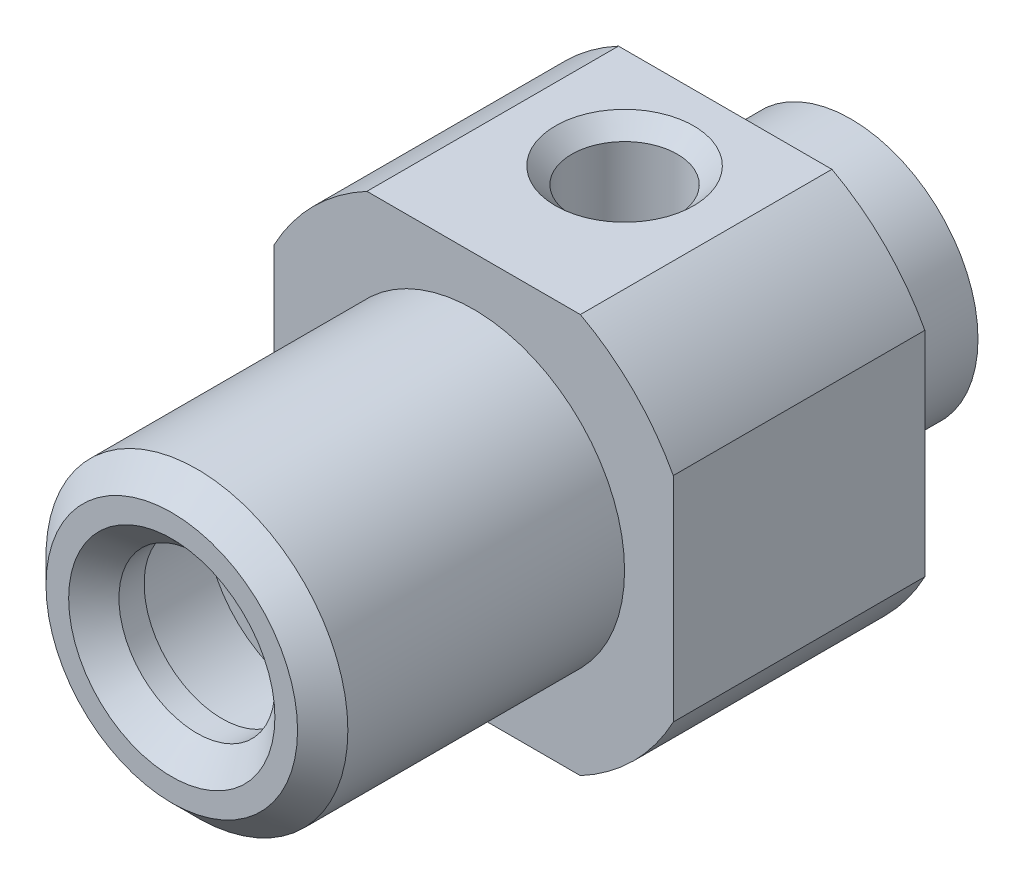
ISO-10303-21;
HEADER;
FILE_DESCRIPTION(('STEP AP214'),'2;1');
FILE_NAME('part.step','',(''),(''),'','','');
FILE_SCHEMA(('AUTOMOTIVE_DESIGN { 1 0 10303 214 1 1 1 1 }'));
ENDSEC;
DATA;
#1=APPLICATION_CONTEXT('core data for automotive mechanical design processes');
#2=APPLICATION_PROTOCOL_DEFINITION('international standard','automotive_design',2000,#1);
#3=PRODUCT_CONTEXT('',#1,'mechanical');
#4=PRODUCT('Part','Part','',(#3));
#5=PRODUCT_RELATED_PRODUCT_CATEGORY('part','',(#4));
#6=PRODUCT_DEFINITION_FORMATION('','',#4);
#7=PRODUCT_DEFINITION_CONTEXT('part definition',#1,'design');
#8=PRODUCT_DEFINITION('design','',#6,#7);
#9=PRODUCT_DEFINITION_SHAPE('','',#8);
#10=(LENGTH_UNIT() NAMED_UNIT(*) SI_UNIT(.MILLI.,.METRE.));
#11=(NAMED_UNIT(*) PLANE_ANGLE_UNIT() SI_UNIT($,.RADIAN.));
#12=(NAMED_UNIT(*) SI_UNIT($,.STERADIAN.) SOLID_ANGLE_UNIT());
#13=UNCERTAINTY_MEASURE_WITH_UNIT(LENGTH_MEASURE(1.E-05),#10,'distance_accuracy_value','');
#14=(GEOMETRIC_REPRESENTATION_CONTEXT(3) GLOBAL_UNCERTAINTY_ASSIGNED_CONTEXT((#13)) GLOBAL_UNIT_ASSIGNED_CONTEXT((#10,
#11,#12)) REPRESENTATION_CONTEXT('',''));
#15=CARTESIAN_POINT('',(0.,0.,0.));
#16=DIRECTION('',(0.,0.,1.));
#17=DIRECTION('',(1.,0.,0.));
#18=AXIS2_PLACEMENT_3D('',#15,#16,#17);
#19=CARTESIAN_POINT('',(0.,6.,1.5));
#20=DIRECTION('',(0.,0.,-1.));
#21=DIRECTION('',(-1.,0.,0.));
#22=AXIS2_PLACEMENT_3D('',#19,#20,#21);
#23=PLANE('',#22);
#24=CARTESIAN_POINT('',(0.,0.,1.5));
#25=DIRECTION('',(0.,0.,1.));
#26=DIRECTION('',(1.,0.,0.));
#27=AXIS2_PLACEMENT_3D('',#24,#25,#26);
#28=CIRCLE('',#27,6.);
#29=CARTESIAN_POINT('',(6.,0.,1.5));
#30=VERTEX_POINT('',#29);
#31=EDGE_CURVE('E237',#30,#30,#28,.T.);
#32=ORIENTED_EDGE('',*,*,#31,.F.);
#33=EDGE_LOOP('',(#32));
#34=FACE_BOUND('',#33,.T.);
#35=CARTESIAN_POINT('',(0.,0.,1.5));
#36=DIRECTION('',(0.,0.,1.));
#37=DIRECTION('',(1.,0.,0.));
#38=AXIS2_PLACEMENT_3D('',#35,#36,#37);
#39=CIRCLE('',#38,9.);
#40=CARTESIAN_POINT('',(7.9375,4.24218030616332,1.5));
#41=VERTEX_POINT('',#40);
#42=CARTESIAN_POINT('',(4.24218030616333,7.9375,1.5));
#43=VERTEX_POINT('',#42);
#44=EDGE_CURVE('E240',#41,#43,#39,.T.);
#45=ORIENTED_EDGE('',*,*,#44,.T.);
#46=DIRECTION('',(1.,0.,0.));
#47=VECTOR('',#46,1.);
#48=CARTESIAN_POINT('',(0.,7.9375,1.5));
#49=LINE('',#48,#47);
#50=CARTESIAN_POINT('',(-4.24218030616333,7.9375,1.5));
#51=VERTEX_POINT('',#50);
#52=EDGE_CURVE('E277',#51,#43,#49,.T.);
#53=ORIENTED_EDGE('',*,*,#52,.F.);
#54=CARTESIAN_POINT('',(-7.9375,4.24218030616333,1.5));
#55=VERTEX_POINT('',#54);
#56=EDGE_CURVE('E243',#51,#55,#39,.T.);
#57=ORIENTED_EDGE('',*,*,#56,.T.);
#58=DIRECTION('',(0.,1.,0.));
#59=VECTOR('',#58,1.);
#60=CARTESIAN_POINT('',(-7.9375,0.,1.5));
#61=LINE('',#60,#59);
#62=CARTESIAN_POINT('',(-7.9375,-4.24218030616333,1.5));
#63=VERTEX_POINT('',#62);
#64=EDGE_CURVE('E278',#63,#55,#61,.T.);
#65=ORIENTED_EDGE('',*,*,#64,.F.);
#66=CARTESIAN_POINT('',(-4.24218030616332,-7.9375,1.5));
#67=VERTEX_POINT('',#66);
#68=EDGE_CURVE('E349',#63,#67,#39,.T.);
#69=ORIENTED_EDGE('',*,*,#68,.T.);
#70=DIRECTION('',(1.,0.,0.));
#71=VECTOR('',#70,1.);
#72=CARTESIAN_POINT('',(0.,-7.9375,1.5));
#73=LINE('',#72,#71);
#74=CARTESIAN_POINT('',(4.24218030616332,-7.9375,1.5));
#75=VERTEX_POINT('',#74);
#76=EDGE_CURVE('E280',#67,#75,#73,.T.);
#77=ORIENTED_EDGE('',*,*,#76,.T.);
#78=CARTESIAN_POINT('',(7.9375,-4.24218030616333,1.5));
#79=VERTEX_POINT('',#78);
#80=EDGE_CURVE('E244',#75,#79,#39,.T.);
#81=ORIENTED_EDGE('',*,*,#80,.T.);
#82=DIRECTION('',(0.,1.,0.));
#83=VECTOR('',#82,1.);
#84=CARTESIAN_POINT('',(7.9375,0.,1.5));
#85=LINE('',#84,#83);
#86=EDGE_CURVE('E293',#79,#41,#85,.T.);
#87=ORIENTED_EDGE('',*,*,#86,.T.);
#88=EDGE_LOOP('',(#45,#53,#57,#65,#69,#77,#81,#87));
#89=FACE_BOUND('',#88,.T.);
#90=ADVANCED_FACE('F40',(#34,#89),#23,.F.);
#91=CARTESIAN_POINT('',(0.,0.,0.));
#92=DIRECTION('',(0.,0.,1.));
#93=DIRECTION('',(1.,0.,0.));
#94=AXIS2_PLACEMENT_3D('',#91,#92,#93);
#95=CYLINDRICAL_SURFACE('',#94,9.);
#96=CARTESIAN_POINT('',(0.,0.,-8.5));
#97=DIRECTION('',(0.,0.,1.));
#98=DIRECTION('',(1.,0.,0.));
#99=AXIS2_PLACEMENT_3D('',#96,#97,#98);
#100=CIRCLE('',#99,9.);
#101=CARTESIAN_POINT('',(7.9375,4.24218030616332,-8.5));
#102=VERTEX_POINT('',#101);
#103=CARTESIAN_POINT('',(4.24218030616333,7.9375,-8.5));
#104=VERTEX_POINT('',#103);
#105=EDGE_CURVE('E245',#102,#104,#100,.T.);
#106=ORIENTED_EDGE('',*,*,#105,.T.);
#107=DIRECTION('',(0.,0.,-1.));
#108=VECTOR('',#107,1.);
#109=CARTESIAN_POINT('',(4.24218030616333,7.9375,13.501));
#110=LINE('',#109,#108);
#111=EDGE_CURVE('E309',#43,#104,#110,.T.);
#112=ORIENTED_EDGE('',*,*,#111,.F.);
#113=ORIENTED_EDGE('',*,*,#44,.F.);
#114=DIRECTION('',(0.,0.,-1.));
#115=VECTOR('',#114,1.);
#116=CARTESIAN_POINT('',(7.9375,4.24218030616332,13.501));
#117=LINE('',#116,#115);
#118=EDGE_CURVE('E298',#41,#102,#117,.T.);
#119=ORIENTED_EDGE('',*,*,#118,.T.);
#120=EDGE_LOOP('',(#106,#112,#113,#119));
#121=FACE_BOUND('',#120,.T.);
#122=ADVANCED_FACE('F190',(#121),#95,.T.);
#123=ORIENTED_EDGE('',*,*,#56,.F.);
#124=DIRECTION('',(0.,0.,-1.));
#125=VECTOR('',#124,1.);
#126=CARTESIAN_POINT('',(-4.24218030616333,7.9375,13.501));
#127=LINE('',#126,#125);
#128=CARTESIAN_POINT('',(-4.24218030616333,7.9375,-8.5));
#129=VERTEX_POINT('',#128);
#130=EDGE_CURVE('E308',#51,#129,#127,.T.);
#131=ORIENTED_EDGE('',*,*,#130,.T.);
#132=CARTESIAN_POINT('',(-7.9375,4.24218030616333,-8.5));
#133=VERTEX_POINT('',#132);
#134=EDGE_CURVE('E248',#129,#133,#100,.T.);
#135=ORIENTED_EDGE('',*,*,#134,.T.);
#136=DIRECTION('',(0.,0.,-1.));
#137=VECTOR('',#136,1.);
#138=CARTESIAN_POINT('',(-7.9375,4.24218030616333,13.501));
#139=LINE('',#138,#137);
#140=EDGE_CURVE('E282',#55,#133,#139,.T.);
#141=ORIENTED_EDGE('',*,*,#140,.F.);
#142=EDGE_LOOP('',(#123,#131,#135,#141));
#143=FACE_BOUND('',#142,.T.);
#144=ADVANCED_FACE('F196',(#143),#95,.T.);
#145=DIRECTION('',(0.,0.,-1.));
#146=VECTOR('',#145,1.);
#147=CARTESIAN_POINT('',(7.9375,-4.24218030616333,13.501));
#148=LINE('',#147,#146);
#149=CARTESIAN_POINT('',(7.9375,-4.24218030616333,-8.5));
#150=VERTEX_POINT('',#149);
#151=EDGE_CURVE('E69',#79,#150,#148,.T.);
#152=ORIENTED_EDGE('',*,*,#151,.F.);
#153=ORIENTED_EDGE('',*,*,#80,.F.);
#154=DIRECTION('',(0.,0.,-1.));
#155=VECTOR('',#154,1.);
#156=CARTESIAN_POINT('',(4.24218030616332,-7.9375,13.501));
#157=LINE('',#156,#155);
#158=CARTESIAN_POINT('',(4.24218030616332,-7.9375,-8.5));
#159=VERTEX_POINT('',#158);
#160=EDGE_CURVE('E287',#75,#159,#157,.T.);
#161=ORIENTED_EDGE('',*,*,#160,.T.);
#162=EDGE_CURVE('E249',#159,#150,#100,.T.);
#163=ORIENTED_EDGE('',*,*,#162,.T.);
#164=EDGE_LOOP('',(#152,#153,#161,#163));
#165=FACE_BOUND('',#164,.T.);
#166=ADVANCED_FACE('F333',(#165),#95,.T.);
#167=DIRECTION('',(0.,0.,-1.));
#168=VECTOR('',#167,1.);
#169=CARTESIAN_POINT('',(-4.24218030616332,-7.9375,13.501));
#170=LINE('',#169,#168);
#171=CARTESIAN_POINT('',(-4.24218030616332,-7.9375,-8.5));
#172=VERTEX_POINT('',#171);
#173=EDGE_CURVE('E290',#67,#172,#170,.T.);
#174=ORIENTED_EDGE('',*,*,#173,.F.);
#175=ORIENTED_EDGE('',*,*,#68,.F.);
#176=DIRECTION('',(0.,0.,-1.));
#177=VECTOR('',#176,1.);
#178=CARTESIAN_POINT('',(-7.9375,-4.24218030616333,13.501));
#179=LINE('',#178,#177);
#180=CARTESIAN_POINT('',(-7.9375,-4.24218030616333,-8.5));
#181=VERTEX_POINT('',#180);
#182=EDGE_CURVE('E281',#63,#181,#179,.T.);
#183=ORIENTED_EDGE('',*,*,#182,.T.);
#184=EDGE_CURVE('E336',#181,#172,#100,.T.);
#185=ORIENTED_EDGE('',*,*,#184,.T.);
#186=EDGE_LOOP('',(#174,#175,#183,#185));
#187=FACE_BOUND('',#186,.T.);
#188=ADVANCED_FACE('F199',(#187),#95,.T.);
#189=CARTESIAN_POINT('',(0.,9.,-8.5));
#190=DIRECTION('',(0.,0.,1.));
#191=DIRECTION('',(1.,0.,0.));
#192=AXIS2_PLACEMENT_3D('',#189,#190,#191);
#193=PLANE('',#192);
#194=CARTESIAN_POINT('',(0.,0.,-8.5));
#195=DIRECTION('',(0.,0.,1.));
#196=DIRECTION('',(1.,0.,0.));
#197=AXIS2_PLACEMENT_3D('',#194,#195,#196);
#198=CIRCLE('',#197,5.75);
#199=CARTESIAN_POINT('',(5.75,0.,-8.5));
#200=VERTEX_POINT('',#199);
#201=EDGE_CURVE('E250',#200,#200,#198,.T.);
#202=ORIENTED_EDGE('',*,*,#201,.T.);
#203=EDGE_LOOP('',(#202));
#204=FACE_BOUND('',#203,.T.);
#205=ORIENTED_EDGE('',*,*,#134,.F.);
#206=DIRECTION('',(-1.,0.,0.));
#207=VECTOR('',#206,1.);
#208=CARTESIAN_POINT('',(0.,7.9375,-8.5));
#209=LINE('',#208,#207);
#210=EDGE_CURVE('E303',#104,#129,#209,.T.);
#211=ORIENTED_EDGE('',*,*,#210,.F.);
#212=ORIENTED_EDGE('',*,*,#105,.F.);
#213=DIRECTION('',(0.,-1.,0.));
#214=VECTOR('',#213,1.);
#215=CARTESIAN_POINT('',(7.9375,0.,-8.5));
#216=LINE('',#215,#214);
#217=EDGE_CURVE('E301',#102,#150,#216,.T.);
#218=ORIENTED_EDGE('',*,*,#217,.T.);
#219=ORIENTED_EDGE('',*,*,#162,.F.);
#220=DIRECTION('',(-1.,0.,0.));
#221=VECTOR('',#220,1.);
#222=CARTESIAN_POINT('',(0.,-7.9375,-8.5));
#223=LINE('',#222,#221);
#224=EDGE_CURVE('E291',#159,#172,#223,.T.);
#225=ORIENTED_EDGE('',*,*,#224,.T.);
#226=ORIENTED_EDGE('',*,*,#184,.F.);
#227=DIRECTION('',(0.,-1.,0.));
#228=VECTOR('',#227,1.);
#229=CARTESIAN_POINT('',(-7.9375,0.,-8.5));
#230=LINE('',#229,#228);
#231=EDGE_CURVE('E130',#133,#181,#230,.T.);
#232=ORIENTED_EDGE('',*,*,#231,.F.);
#233=EDGE_LOOP('',(#205,#211,#212,#218,#219,#225,#226,#232));
#234=FACE_BOUND('',#233,.T.);
#235=ADVANCED_FACE('F222',(#204,#234),#193,.F.);
#236=CARTESIAN_POINT('',(0.,0.,0.));
#237=DIRECTION('',(0.,0.,1.));
#238=DIRECTION('',(1.,0.,0.));
#239=AXIS2_PLACEMENT_3D('',#236,#237,#238);
#240=CYLINDRICAL_SURFACE('',#239,3.1);
#241=CARTESIAN_POINT('',(0.,0.,11.5));
#242=DIRECTION('',(0.,0.,1.));
#243=DIRECTION('',(1.,0.,0.));
#244=AXIS2_PLACEMENT_3D('',#241,#242,#243);
#245=CIRCLE('',#244,3.1);
#246=CARTESIAN_POINT('',(3.1,0.,11.5));
#247=VERTEX_POINT('',#246);
#248=EDGE_CURVE('E274',#247,#247,#245,.T.);
#249=ORIENTED_EDGE('',*,*,#248,.F.);
#250=EDGE_LOOP('',(#249));
#251=FACE_BOUND('',#250,.T.);
#252=CARTESIAN_POINT('',(0.,0.,12.5));
#253=DIRECTION('',(0.,0.,1.));
#254=DIRECTION('',(1.,0.,0.));
#255=AXIS2_PLACEMENT_3D('',#252,#253,#254);
#256=CIRCLE('',#255,3.1);
#257=CARTESIAN_POINT('',(3.1,0.,12.5));
#258=VERTEX_POINT('',#257);
#259=EDGE_CURVE('E143',#258,#258,#256,.T.);
#260=ORIENTED_EDGE('',*,*,#259,.T.);
#261=EDGE_LOOP('',(#260));
#262=FACE_BOUND('',#261,.T.);
#263=ADVANCED_FACE('F42',(#251,#262),#240,.F.);
#264=CARTESIAN_POINT('',(0.,0.,13.5));
#265=DIRECTION('',(0.,0.,1.));
#266=DIRECTION('',(1.,0.,0.));
#267=AXIS2_PLACEMENT_3D('',#264,#265,#266);
#268=CONICAL_SURFACE('',#267,4.10000000000001,0.78539816339745);
#269=ORIENTED_EDGE('',*,*,#259,.F.);
#270=EDGE_LOOP('',(#269));
#271=FACE_BOUND('',#270,.T.);
#272=CARTESIAN_POINT('',(0.,0.,13.5));
#273=DIRECTION('',(0.,0.,1.));
#274=DIRECTION('',(1.,0.,0.));
#275=AXIS2_PLACEMENT_3D('',#272,#273,#274);
#276=CIRCLE('',#275,4.10000000000001);
#277=CARTESIAN_POINT('',(4.10000000000001,0.,13.5));
#278=VERTEX_POINT('',#277);
#279=EDGE_CURVE('E229',#278,#278,#276,.T.);
#280=ORIENTED_EDGE('',*,*,#279,.T.);
#281=EDGE_LOOP('',(#280));
#282=FACE_BOUND('',#281,.T.);
#283=ADVANCED_FACE('F215',(#271,#282),#268,.F.);
#284=CARTESIAN_POINT('',(0.,4.10000000000001,13.5));
#285=DIRECTION('',(0.,0.,-1.));
#286=DIRECTION('',(-1.,0.,0.));
#287=AXIS2_PLACEMENT_3D('',#284,#285,#286);
#288=PLANE('',#287);
#289=ORIENTED_EDGE('',*,*,#279,.F.);
#290=EDGE_LOOP('',(#289));
#291=FACE_BOUND('',#290,.T.);
#292=CARTESIAN_POINT('',(0.,0.,13.5));
#293=DIRECTION('',(0.,0.,1.));
#294=DIRECTION('',(1.,0.,0.));
#295=AXIS2_PLACEMENT_3D('',#292,#293,#294);
#296=CIRCLE('',#295,5.);
#297=CARTESIAN_POINT('',(5.,0.,13.5));
#298=VERTEX_POINT('',#297);
#299=EDGE_CURVE('E230',#298,#298,#296,.T.);
#300=ORIENTED_EDGE('',*,*,#299,.T.);
#301=EDGE_LOOP('',(#300));
#302=FACE_BOUND('',#301,.T.);
#303=ADVANCED_FACE('F212',(#291,#302),#288,.F.);
#304=CARTESIAN_POINT('',(0.,0.,12.5));
#305=DIRECTION('',(0.,0.,-1.));
#306=DIRECTION('',(-1.,0.,0.));
#307=AXIS2_PLACEMENT_3D('',#304,#305,#306);
#308=CONICAL_SURFACE('',#307,6.,0.785398163397447);
#309=ORIENTED_EDGE('',*,*,#299,.F.);
#310=EDGE_LOOP('',(#309));
#311=FACE_BOUND('',#310,.T.);
#312=CARTESIAN_POINT('',(0.,0.,12.5));
#313=DIRECTION('',(0.,0.,1.));
#314=DIRECTION('',(1.,0.,0.));
#315=AXIS2_PLACEMENT_3D('',#312,#313,#314);
#316=CIRCLE('',#315,6.);
#317=CARTESIAN_POINT('',(6.,0.,12.5));
#318=VERTEX_POINT('',#317);
#319=EDGE_CURVE('E232',#318,#318,#316,.T.);
#320=ORIENTED_EDGE('',*,*,#319,.T.);
#321=EDGE_LOOP('',(#320));
#322=FACE_BOUND('',#321,.T.);
#323=ADVANCED_FACE('F208',(#311,#322),#308,.T.);
#324=CARTESIAN_POINT('',(0.,0.,0.));
#325=DIRECTION('',(0.,0.,1.));
#326=DIRECTION('',(1.,0.,0.));
#327=AXIS2_PLACEMENT_3D('',#324,#325,#326);
#328=CYLINDRICAL_SURFACE('',#327,6.);
#329=ORIENTED_EDGE('',*,*,#319,.F.);
#330=EDGE_LOOP('',(#329));
#331=FACE_BOUND('',#330,.T.);
#332=ORIENTED_EDGE('',*,*,#31,.T.);
#333=EDGE_LOOP('',(#332));
#334=FACE_BOUND('',#333,.T.);
#335=ADVANCED_FACE('F204',(#331,#334),#328,.T.);
#336=CARTESIAN_POINT('',(0.,0.,0.));
#337=DIRECTION('',(0.,0.,1.));
#338=DIRECTION('',(1.,0.,0.));
#339=AXIS2_PLACEMENT_3D('',#336,#337,#338);
#340=CYLINDRICAL_SURFACE('',#339,5.75);
#341=ORIENTED_EDGE('',*,*,#201,.F.);
#342=EDGE_LOOP('',(#341));
#343=FACE_BOUND('',#342,.T.);
#344=CARTESIAN_POINT('',(0.,0.,-9.85));
#345=DIRECTION('',(0.,0.,1.));
#346=DIRECTION('',(1.,0.,0.));
#347=AXIS2_PLACEMENT_3D('',#344,#345,#346);
#348=CIRCLE('',#347,5.75);
#349=CARTESIAN_POINT('',(5.75,0.,-9.85));
#350=VERTEX_POINT('',#349);
#351=EDGE_CURVE('E253',#350,#350,#348,.T.);
#352=ORIENTED_EDGE('',*,*,#351,.T.);
#353=EDGE_LOOP('',(#352));
#354=FACE_BOUND('',#353,.T.);
#355=ADVANCED_FACE('F207',(#343,#354),#340,.T.);
#356=CARTESIAN_POINT('',(0.,5.75,-9.85));
#357=DIRECTION('',(0.,0.,1.));
#358=DIRECTION('',(1.,0.,0.));
#359=AXIS2_PLACEMENT_3D('',#356,#357,#358);
#360=PLANE('',#359);
#361=ORIENTED_EDGE('',*,*,#351,.F.);
#362=EDGE_LOOP('',(#361));
#363=FACE_BOUND('',#362,.T.);
#364=CARTESIAN_POINT('',(0.,0.,-9.85));
#365=DIRECTION('',(0.,0.,1.));
#366=DIRECTION('',(1.,0.,0.));
#367=AXIS2_PLACEMENT_3D('',#364,#365,#366);
#368=CIRCLE('',#367,5.05);
#369=CARTESIAN_POINT('',(5.05,0.,-9.85));
#370=VERTEX_POINT('',#369);
#371=EDGE_CURVE('E256',#370,#370,#368,.T.);
#372=ORIENTED_EDGE('',*,*,#371,.T.);
#373=EDGE_LOOP('',(#372));
#374=FACE_BOUND('',#373,.T.);
#375=ADVANCED_FACE('F406',(#363,#374),#360,.F.);
#376=CARTESIAN_POINT('',(0.,0.,0.));
#377=DIRECTION('',(0.,0.,1.));
#378=DIRECTION('',(1.,0.,0.));
#379=AXIS2_PLACEMENT_3D('',#376,#377,#378);
#380=CYLINDRICAL_SURFACE('',#379,5.05);
#381=ORIENTED_EDGE('',*,*,#371,.F.);
#382=EDGE_LOOP('',(#381));
#383=FACE_BOUND('',#382,.T.);
#384=CARTESIAN_POINT('',(0.,0.,-13.5));
#385=DIRECTION('',(0.,0.,1.));
#386=DIRECTION('',(1.,0.,0.));
#387=AXIS2_PLACEMENT_3D('',#384,#385,#386);
#388=CIRCLE('',#387,5.05);
#389=CARTESIAN_POINT('',(5.05,0.,-13.5));
#390=VERTEX_POINT('',#389);
#391=EDGE_CURVE('E259',#390,#390,#388,.T.);
#392=ORIENTED_EDGE('',*,*,#391,.T.);
#393=EDGE_LOOP('',(#392));
#394=FACE_BOUND('',#393,.T.);
#395=ADVANCED_FACE('F397',(#383,#394),#380,.T.);
#396=CARTESIAN_POINT('',(0.,5.05,-13.5));
#397=DIRECTION('',(0.,0.,1.));
#398=DIRECTION('',(1.,0.,0.));
#399=AXIS2_PLACEMENT_3D('',#396,#397,#398);
#400=PLANE('',#399);
#401=ORIENTED_EDGE('',*,*,#391,.F.);
#402=EDGE_LOOP('',(#401));
#403=FACE_BOUND('',#402,.T.);
#404=CARTESIAN_POINT('',(0.,0.,-13.5));
#405=DIRECTION('',(0.,0.,1.));
#406=DIRECTION('',(1.,0.,0.));
#407=AXIS2_PLACEMENT_3D('',#404,#405,#406);
#408=CIRCLE('',#407,2.25);
#409=CARTESIAN_POINT('',(2.25,0.,-13.5));
#410=VERTEX_POINT('',#409);
#411=EDGE_CURVE('E262',#410,#410,#408,.T.);
#412=ORIENTED_EDGE('',*,*,#411,.T.);
#413=EDGE_LOOP('',(#412));
#414=FACE_BOUND('',#413,.T.);
#415=ADVANCED_FACE('F186',(#403,#414),#400,.F.);
#416=CARTESIAN_POINT('',(0.,0.,0.));
#417=DIRECTION('',(0.,0.,1.));
#418=DIRECTION('',(1.,0.,0.));
#419=AXIS2_PLACEMENT_3D('',#416,#417,#418);
#420=CYLINDRICAL_SURFACE('',#419,2.25);
#421=DIRECTION('',(0.,0.,1.));
#422=VECTOR('',#421,1.);
#423=CARTESIAN_POINT('',(2.04538352149419,0.937500000000003,0.));
#424=LINE('',#423,#422);
#425=CARTESIAN_POINT('',(2.04538352149419,0.937500000000006,-4.02417834223314));
#426=VERTEX_POINT('',#425);
#427=CARTESIAN_POINT('',(2.04538352149419,0.937500000000006,-4.97582165776682));
#428=VERTEX_POINT('',#427);
#429=EDGE_CURVE('E54',#426,#428,#424,.F.);
#430=ORIENTED_EDGE('',*,*,#429,.T.);
#431=CARTESIAN_POINT('',(2.04538352149419,0.937500000000006,-4.97582165776685));
#432=CARTESIAN_POINT('',(2.03769506876895,0.954285861893541,-5.0088463481007));
#433=CARTESIAN_POINT('',(2.02932820666342,0.971983336024863,-5.04121484970983));
#434=CARTESIAN_POINT('',(2.01130714332788,1.008740263602,-5.10476331754226));
#435=CARTESIAN_POINT('',(2.00165410062062,1.02779848427243,-5.13594432127476));
#436=CARTESIAN_POINT('',(1.97088830893697,1.0862935597974,-5.22785535289002));
#437=CARTESIAN_POINT('',(1.94793765157081,1.12712150560826,-5.28708421190127));
#438=CARTESIAN_POINT('',(1.89717333000401,1.21063847915185,-5.40262630277086));
#439=CARTESIAN_POINT('',(1.86933031076587,1.25333750178561,-5.45891911190074));
#440=CARTESIAN_POINT('',(1.80886201479935,1.33913259820842,-5.56861663767527));
#441=CARTESIAN_POINT('',(1.77623401948123,1.38222888457199,-5.62201968873061));
#442=CARTESIAN_POINT('',(1.70638893708213,1.46756716551144,-5.72560413656642));
#443=CARTESIAN_POINT('',(1.66920889565588,1.50981317445065,-5.77580706772242));
#444=CARTESIAN_POINT('',(1.58998104486053,1.59303727882719,-5.87328351900989));
#445=CARTESIAN_POINT('',(1.54793383415681,1.63401552941562,-5.92055739832101));
#446=CARTESIAN_POINT('',(1.41446819544071,1.7538581160714,-6.05739298208148));
#447=CARTESIAN_POINT('',(1.31547126409139,1.82995396979926,-6.14235253661036));
#448=CARTESIAN_POINT('',(1.1290761117621,1.94835285027546,-6.27315776483378));
#449=CARTESIAN_POINT('',(1.04673487122654,1.99403447051162,-6.32318003428906));
#450=CARTESIAN_POINT('',(0.872264541033667,2.07627771379797,-6.41278587478176));
#451=CARTESIAN_POINT('',(0.780139899124074,2.11284345602951,-6.4523741610755));
#452=CARTESIAN_POINT('',(0.58661909215988,2.17457658690596,-6.51901987808489));
#453=CARTESIAN_POINT('',(0.485139265309949,2.19962607570369,-6.54594775613417));
#454=CARTESIAN_POINT('',(0.276866743481708,2.23538767402996,-6.58434847563899));
#455=CARTESIAN_POINT('',(0.170080840473331,2.24611764645433,-6.595840572592));
#456=CARTESIAN_POINT('',(-0.0283452807846901,2.25167712156069,-6.60179666388817));
#457=CARTESIAN_POINT('',(-0.119867929244496,2.24864025756947,-6.59854557887685));
#458=CARTESIAN_POINT('',(-0.300697409309738,2.231663838865,-6.58034479968534));
#459=CARTESIAN_POINT('',(-0.390004184364244,2.2177240061936,-6.56539480725548));
#460=CARTESIAN_POINT('',(-0.560609153143667,2.18072397807296,-6.52561298852541));
#461=CARTESIAN_POINT('',(-0.642082799948599,2.1580312059448,-6.50117903943971));
#462=CARTESIAN_POINT('',(-0.799228292446634,2.10490467662864,-6.44376992615126));
#463=CARTESIAN_POINT('',(-0.874899106023678,2.07446954648959,-6.41079324704859));
#464=CARTESIAN_POINT('',(-1.05136343632204,1.99256010550127,-6.32160179627656));
#465=CARTESIAN_POINT('',(-1.14864426060331,1.93770935479381,-6.26153504190506));
#466=CARTESIAN_POINT('',(-1.32897308738269,1.81880665925042,-6.12983822607349));
#467=CARTESIAN_POINT('',(-1.41197352484435,1.75472522283874,-6.05817100728664));
#468=CARTESIAN_POINT('',(-1.53801524600702,1.64361853057092,-5.93162790699897));
#469=CARTESIAN_POINT('',(-1.58507154312854,1.59816362295841,-5.87928147974168));
#470=CARTESIAN_POINT('',(-1.67314889401385,1.50570486426786,-5.77100144564314));
#471=CARTESIAN_POINT('',(-1.71417015702764,1.45870106696297,-5.71506796327085));
#472=CARTESIAN_POINT('',(-1.79024222866635,1.36425728625974,-5.5999037079485));
#473=CARTESIAN_POINT('',(-1.82530625920745,1.31681852179624,-5.54068063465119));
#474=CARTESIAN_POINT('',(-1.88965371276692,1.2226838723372,-5.41867446537074));
#475=CARTESIAN_POINT('',(-1.91894095178551,1.17598751579914,-5.35589375499855));
#476=CARTESIAN_POINT('',(-1.96553368767488,1.09580003068807,-5.24132814500062));
#477=CARTESIAN_POINT('',(-1.984038794767,1.06177811096043,-5.19041278931911));
#478=CARTESIAN_POINT('',(-2.0174521143053,0.996879331063774,-5.08554588811934));
#479=CARTESIAN_POINT('',(-2.03236180896044,0.966001177920633,-5.03159560510132));
#480=CARTESIAN_POINT('',(-2.04538352149419,0.937500000000006,-4.97582165776685));
#481=B_SPLINE_CURVE_WITH_KNOTS('',3,(#431,#432,#433,#434,#435,#436,#437,#438,#439,#440,#441,
#442,#443,#444,#445,#446,#447,#448,#449,#450,#451,#452,#453,#454,#455,#456,#457,#458,#459,#460,
#461,#462,#463,#464,#465,#466,#467,#468,#469,#470,#471,#472,#473,#474,#475,#476,#477,#478,#479,
#480),.UNSPECIFIED.,.F.,.F.,(4,2,2,2,2,2,2,2,2,2,2,2,2,2,2,2,2,2,2,2,2,2,2,2,4),(0.,
0.113437255512295,0.226773014978205,0.452990990141825,0.680615796940032,0.908370433691744,
1.13438142123065,1.3603646387339,1.81065980834888,2.1294402489059,2.44807638034924,
2.76990569574004,3.09133316836749,3.36480013622895,3.63827407603087,3.90133665442205,
4.16444591421376,4.54279348146345,4.92237782528216,5.17345455709219,5.42452258137927,
5.67502587340892,5.92536313109941,6.11705422731367,6.30866616324749),.UNSPECIFIED.);
#482=CARTESIAN_POINT('',(-2.04538352149419,0.937500000000006,-4.97582165776682));
#483=VERTEX_POINT('',#482);
#484=EDGE_CURVE('E11',#428,#483,#481,.T.);
#485=ORIENTED_EDGE('',*,*,#484,.T.);
#486=DIRECTION('',(0.,0.,1.));
#487=VECTOR('',#486,1.);
#488=CARTESIAN_POINT('',(-2.04538352149419,0.937500000000003,0.));
#489=LINE('',#488,#487);
#490=CARTESIAN_POINT('',(-2.04538352149419,0.937500000000006,-4.02417834223317));
#491=VERTEX_POINT('',#490);
#492=EDGE_CURVE('E135',#483,#491,#489,.T.);
#493=ORIENTED_EDGE('',*,*,#492,.T.);
#494=CARTESIAN_POINT('',(-2.04538352149419,0.937500000000006,-4.02417834223315));
#495=CARTESIAN_POINT('',(-2.03769506876895,0.954285861893541,-3.9911536518993));
#496=CARTESIAN_POINT('',(-2.02932820666342,0.971983336024862,-3.95878515029016));
#497=CARTESIAN_POINT('',(-2.01130714332788,1.008740263602,-3.89523668245774));
#498=CARTESIAN_POINT('',(-2.00165410062062,1.02779848427243,-3.86405567872523));
#499=CARTESIAN_POINT('',(-1.97088830893697,1.0862935597974,-3.77214464710998));
#500=CARTESIAN_POINT('',(-1.94793765157081,1.12712150560826,-3.71291578809873));
#501=CARTESIAN_POINT('',(-1.89717333000401,1.21063847915185,-3.59737369722914));
#502=CARTESIAN_POINT('',(-1.86933031076587,1.2533375017856,-3.54108088809926));
#503=CARTESIAN_POINT('',(-1.80886201479936,1.33913259820842,-3.43138336232473));
#504=CARTESIAN_POINT('',(-1.77623401948123,1.38222888457199,-3.37798031126939));
#505=CARTESIAN_POINT('',(-1.70638893708214,1.46756716551144,-3.27439586343358));
#506=CARTESIAN_POINT('',(-1.66920889565588,1.50981317445065,-3.22419293227758));
#507=CARTESIAN_POINT('',(-1.58998104486054,1.59303727882718,-3.12671648099011));
#508=CARTESIAN_POINT('',(-1.54793383415682,1.63401552941561,-3.07944260167899));
#509=CARTESIAN_POINT('',(-1.41446819544072,1.75385811607139,-2.94260701791853));
#510=CARTESIAN_POINT('',(-1.3154712640914,1.82995396979925,-2.85764746338964));
#511=CARTESIAN_POINT('',(-1.12907611176212,1.94835285027545,-2.72684223516622));
#512=CARTESIAN_POINT('',(-1.04673487122655,1.99403447051162,-2.67681996571094));
#513=CARTESIAN_POINT('',(-0.872264541033678,2.07627771379797,-2.58721412521824));
#514=CARTESIAN_POINT('',(-0.780139899124085,2.11284345602951,-2.5476258389245));
#515=CARTESIAN_POINT('',(-0.586619092159891,2.17457658690595,-2.48098012191511));
#516=CARTESIAN_POINT('',(-0.48513926530996,2.19962607570369,-2.45405224386583));
#517=CARTESIAN_POINT('',(-0.276866743481718,2.23538767402995,-2.41565152436101));
#518=CARTESIAN_POINT('',(-0.170080840473341,2.24611764645433,-2.40415942740799));
#519=CARTESIAN_POINT('',(0.0283452807846814,2.25167712156069,-2.39820333611183));
#520=CARTESIAN_POINT('',(0.119867929244488,2.24864025756947,-2.40145442112314));
#521=CARTESIAN_POINT('',(0.30069740930973,2.231663838865,-2.41965520031465));
#522=CARTESIAN_POINT('',(0.390004184364236,2.2177240061936,-2.43460519274451));
#523=CARTESIAN_POINT('',(0.560609153143659,2.18072397807296,-2.47438701147458));
#524=CARTESIAN_POINT('',(0.642082799948592,2.1580312059448,-2.49882096056028));
#525=CARTESIAN_POINT('',(0.799228292446627,2.10490467662864,-2.55623007384873));
#526=CARTESIAN_POINT('',(0.874899106023671,2.0744695464896,-2.5892067529514));
#527=CARTESIAN_POINT('',(1.05136343632204,1.99256010550128,-2.67839820372343));
#528=CARTESIAN_POINT('',(1.1486442606033,1.93770935479381,-2.73846495809493));
#529=CARTESIAN_POINT('',(1.32897308738268,1.81880665925042,-2.87016177392649));
#530=CARTESIAN_POINT('',(1.41197352484434,1.75472522283874,-2.94182899271335));
#531=CARTESIAN_POINT('',(1.53801524600701,1.64361853057093,-3.06837209300101));
#532=CARTESIAN_POINT('',(1.58507154312854,1.59816362295842,-3.12071852025831));
#533=CARTESIAN_POINT('',(1.67314889401384,1.50570486426787,-3.22899855435684));
#534=CARTESIAN_POINT('',(1.71417015702764,1.45870106696298,-3.28493203672913));
#535=CARTESIAN_POINT('',(1.79024222866634,1.36425728625975,-3.40009629205149));
#536=CARTESIAN_POINT('',(1.82530625920745,1.31681852179625,-3.45931936534879));
#537=CARTESIAN_POINT('',(1.88965371276691,1.22268387233721,-3.58132553462924));
#538=CARTESIAN_POINT('',(1.91894095178551,1.17598751579914,-3.64410624500143));
#539=CARTESIAN_POINT('',(1.96553368767487,1.09580003068807,-3.75867185499937));
#540=CARTESIAN_POINT('',(1.984038794767,1.06177811096044,-3.80958721068088));
#541=CARTESIAN_POINT('',(2.0174521143053,0.996879331063776,-3.91445411188065));
#542=CARTESIAN_POINT('',(2.03236180896044,0.966001177920634,-3.96840439489867));
#543=CARTESIAN_POINT('',(2.04538352149419,0.937500000000006,-4.02417834223314));
#544=B_SPLINE_CURVE_WITH_KNOTS('',3,(#494,#495,#496,#497,#498,#499,#500,#501,#502,#503,#504,
#505,#506,#507,#508,#509,#510,#511,#512,#513,#514,#515,#516,#517,#518,#519,#520,#521,#522,#523,
#524,#525,#526,#527,#528,#529,#530,#531,#532,#533,#534,#535,#536,#537,#538,#539,#540,#541,#542,
#543),.UNSPECIFIED.,.F.,.F.,(4,2,2,2,2,2,2,2,2,2,2,2,2,2,2,2,2,2,2,2,2,2,2,2,4),(0.,
0.113437255512294,0.226773014978202,0.452990990141823,0.680615796940028,0.908370433691739,
1.13438142123064,1.36036463873389,1.81065980834887,2.12944024890589,2.44807638034923,
2.76990569574003,3.09133316836748,3.36480013622894,3.63827407603087,3.90133665442205,
4.16444591421375,4.54279348146344,4.92237782528215,5.17345455709218,5.42452258137926,
5.67502587340891,5.9253631310994,6.11705422731367,6.30866616324749),.UNSPECIFIED.);
#545=EDGE_CURVE('E134',#491,#426,#544,.T.);
#546=ORIENTED_EDGE('',*,*,#545,.T.);
#547=EDGE_LOOP('',(#430,#485,#493,#546));
#548=FACE_BOUND('',#547,.T.);
#549=ORIENTED_EDGE('',*,*,#411,.F.);
#550=EDGE_LOOP('',(#549));
#551=FACE_BOUND('',#550,.T.);
#552=CARTESIAN_POINT('',(0.,0.,8.));
#553=DIRECTION('',(0.,0.,1.));
#554=DIRECTION('',(1.,0.,0.));
#555=AXIS2_PLACEMENT_3D('',#552,#553,#554);
#556=CIRCLE('',#555,2.25);
#557=CARTESIAN_POINT('',(2.25,0.,8.));
#558=VERTEX_POINT('',#557);
#559=EDGE_CURVE('E265',#558,#558,#556,.T.);
#560=ORIENTED_EDGE('',*,*,#559,.T.);
#561=EDGE_LOOP('',(#560));
#562=FACE_BOUND('',#561,.T.);
#563=ADVANCED_FACE('F132',(#548,#551,#562),#420,.F.);
#564=CARTESIAN_POINT('',(0.,4.15,8.));
#565=DIRECTION('',(0.,0.,-1.));
#566=DIRECTION('',(-1.,0.,0.));
#567=AXIS2_PLACEMENT_3D('',#564,#565,#566);
#568=PLANE('',#567);
#569=ORIENTED_EDGE('',*,*,#559,.F.);
#570=EDGE_LOOP('',(#569));
#571=FACE_BOUND('',#570,.T.);
#572=CARTESIAN_POINT('',(0.,0.,8.));
#573=DIRECTION('',(0.,0.,1.));
#574=DIRECTION('',(1.,0.,0.));
#575=AXIS2_PLACEMENT_3D('',#572,#573,#574);
#576=CIRCLE('',#575,4.15);
#577=CARTESIAN_POINT('',(4.15,0.,8.));
#578=VERTEX_POINT('',#577);
#579=EDGE_CURVE('E268',#578,#578,#576,.T.);
#580=ORIENTED_EDGE('',*,*,#579,.T.);
#581=EDGE_LOOP('',(#580));
#582=FACE_BOUND('',#581,.T.);
#583=ADVANCED_FACE('F179',(#571,#582),#568,.F.);
#584=CARTESIAN_POINT('',(0.,0.,0.));
#585=DIRECTION('',(0.,0.,1.));
#586=DIRECTION('',(1.,0.,0.));
#587=AXIS2_PLACEMENT_3D('',#584,#585,#586);
#588=CYLINDRICAL_SURFACE('',#587,4.15);
#589=ORIENTED_EDGE('',*,*,#579,.F.);
#590=EDGE_LOOP('',(#589));
#591=FACE_BOUND('',#590,.T.);
#592=CARTESIAN_POINT('',(0.,0.,11.5));
#593=DIRECTION('',(0.,0.,1.));
#594=DIRECTION('',(1.,0.,0.));
#595=AXIS2_PLACEMENT_3D('',#592,#593,#594);
#596=CIRCLE('',#595,4.15);
#597=CARTESIAN_POINT('',(4.15,0.,11.5));
#598=VERTEX_POINT('',#597);
#599=EDGE_CURVE('E271',#598,#598,#596,.T.);
#600=ORIENTED_EDGE('',*,*,#599,.T.);
#601=EDGE_LOOP('',(#600));
#602=FACE_BOUND('',#601,.T.);
#603=ADVANCED_FACE('F176',(#591,#602),#588,.F.);
#604=CARTESIAN_POINT('',(0.,3.1,11.5));
#605=DIRECTION('',(0.,0.,1.));
#606=DIRECTION('',(1.,0.,0.));
#607=AXIS2_PLACEMENT_3D('',#604,#605,#606);
#608=PLANE('',#607);
#609=ORIENTED_EDGE('',*,*,#599,.F.);
#610=EDGE_LOOP('',(#609));
#611=FACE_BOUND('',#610,.T.);
#612=ORIENTED_EDGE('',*,*,#248,.T.);
#613=EDGE_LOOP('',(#612));
#614=FACE_BOUND('',#613,.T.);
#615=ADVANCED_FACE('F172',(#611,#614),#608,.F.);
#616=CARTESIAN_POINT('',(-7.9375,0.,13.501));
#617=DIRECTION('',(1.,0.,0.));
#618=DIRECTION('',(0.,0.,-1.));
#619=AXIS2_PLACEMENT_3D('',#616,#617,#618);
#620=PLANE('',#619);
#621=ORIENTED_EDGE('',*,*,#64,.T.);
#622=ORIENTED_EDGE('',*,*,#140,.T.);
#623=ORIENTED_EDGE('',*,*,#231,.T.);
#624=ORIENTED_EDGE('',*,*,#182,.F.);
#625=EDGE_LOOP('',(#621,#622,#623,#624));
#626=FACE_BOUND('',#625,.T.);
#627=ADVANCED_FACE('F168',(#626),#620,.F.);
#628=CARTESIAN_POINT('',(0.,-7.9375,13.501));
#629=DIRECTION('',(0.,-1.,0.));
#630=DIRECTION('',(0.,0.,-1.));
#631=AXIS2_PLACEMENT_3D('',#628,#629,#630);
#632=PLANE('',#631);
#633=ORIENTED_EDGE('',*,*,#173,.T.);
#634=ORIENTED_EDGE('',*,*,#224,.F.);
#635=ORIENTED_EDGE('',*,*,#160,.F.);
#636=ORIENTED_EDGE('',*,*,#76,.F.);
#637=EDGE_LOOP('',(#633,#634,#635,#636));
#638=FACE_BOUND('',#637,.T.);
#639=ADVANCED_FACE('F165',(#638),#632,.T.);
#640=CARTESIAN_POINT('',(7.9375,0.,13.501));
#641=DIRECTION('',(1.,0.,0.));
#642=DIRECTION('',(0.,1.,0.));
#643=AXIS2_PLACEMENT_3D('',#640,#641,#642);
#644=PLANE('',#643);
#645=ORIENTED_EDGE('',*,*,#151,.T.);
#646=ORIENTED_EDGE('',*,*,#217,.F.);
#647=ORIENTED_EDGE('',*,*,#118,.F.);
#648=ORIENTED_EDGE('',*,*,#86,.F.);
#649=EDGE_LOOP('',(#645,#646,#647,#648));
#650=FACE_BOUND('',#649,.T.);
#651=ADVANCED_FACE('F161',(#650),#644,.T.);
#652=CARTESIAN_POINT('',(0.,7.9375,13.501));
#653=DIRECTION('',(0.,-1.,0.));
#654=DIRECTION('',(0.,0.,-1.));
#655=AXIS2_PLACEMENT_3D('',#652,#653,#654);
#656=PLANE('',#655);
#657=CARTESIAN_POINT('',(0.,7.9375,-4.5));
#658=DIRECTION('',(0.,1.,0.));
#659=DIRECTION('',(0.,0.,1.));
#660=AXIS2_PLACEMENT_3D('',#657,#658,#659);
#661=CIRCLE('',#660,2.75);
#662=CARTESIAN_POINT('',(0.,7.9375,-1.75));
#663=VERTEX_POINT('',#662);
#664=EDGE_CURVE('E317',#663,#663,#661,.T.);
#665=ORIENTED_EDGE('',*,*,#664,.F.);
#666=EDGE_LOOP('',(#665));
#667=FACE_BOUND('',#666,.T.);
#668=ORIENTED_EDGE('',*,*,#52,.T.);
#669=ORIENTED_EDGE('',*,*,#111,.T.);
#670=ORIENTED_EDGE('',*,*,#210,.T.);
#671=ORIENTED_EDGE('',*,*,#130,.F.);
#672=EDGE_LOOP('',(#668,#669,#670,#671));
#673=FACE_BOUND('',#672,.T.);
#674=ADVANCED_FACE('F158',(#667,#673),#656,.F.);
#675=CARTESIAN_POINT('',(0.,0.937500000000003,-4.5));
#676=DIRECTION('',(0.,-1.,0.));
#677=DIRECTION('',(0.,0.,-1.));
#678=AXIS2_PLACEMENT_3D('',#675,#676,#677);
#679=PLANE('',#678);
#680=CARTESIAN_POINT('',(0.,0.937500000000006,-4.5));
#681=DIRECTION('',(0.,1.,0.));
#682=DIRECTION('',(0.,0.,1.));
#683=AXIS2_PLACEMENT_3D('',#680,#681,#682);
#684=CIRCLE('',#683,2.09999999999999);
#685=EDGE_CURVE('E61',#426,#428,#684,.T.);
#686=ORIENTED_EDGE('',*,*,#685,.T.);
#687=ORIENTED_EDGE('',*,*,#429,.F.);
#688=EDGE_LOOP('',(#686,#687));
#689=FACE_BOUND('',#688,.T.);
#690=ADVANCED_FACE('F128',(#689),#679,.F.);
#691=EDGE_CURVE('E123',#483,#491,#684,.T.);
#692=ORIENTED_EDGE('',*,*,#691,.T.);
#693=ORIENTED_EDGE('',*,*,#492,.F.);
#694=EDGE_LOOP('',(#692,#693));
#695=FACE_BOUND('',#694,.T.);
#696=ADVANCED_FACE('F153',(#695),#679,.F.);
#697=CARTESIAN_POINT('',(0.,7.9375,-4.5));
#698=DIRECTION('',(0.,1.,0.));
#699=DIRECTION('',(0.,0.,1.));
#700=AXIS2_PLACEMENT_3D('',#697,#698,#699);
#701=CYLINDRICAL_SURFACE('',#700,2.09999999999999);
#702=CARTESIAN_POINT('',(0.,7.2875,-4.5));
#703=DIRECTION('',(0.,1.,0.));
#704=DIRECTION('',(0.,0.,1.));
#705=AXIS2_PLACEMENT_3D('',#702,#703,#704);
#706=CIRCLE('',#705,2.1);
#707=CARTESIAN_POINT('',(0.,7.2875,-2.4));
#708=VERTEX_POINT('',#707);
#709=EDGE_CURVE('E314',#708,#708,#706,.T.);
#710=ORIENTED_EDGE('',*,*,#709,.T.);
#711=EDGE_LOOP('',(#710));
#712=FACE_BOUND('',#711,.T.);
#713=ORIENTED_EDGE('',*,*,#685,.F.);
#714=ORIENTED_EDGE('',*,*,#545,.F.);
#715=ORIENTED_EDGE('',*,*,#691,.F.);
#716=ORIENTED_EDGE('',*,*,#484,.F.);
#717=EDGE_LOOP('',(#713,#714,#715,#716));
#718=FACE_BOUND('',#717,.T.);
#719=ADVANCED_FACE('F121',(#712,#718),#701,.F.);
#720=CARTESIAN_POINT('',(0.,7.9375,-4.5));
#721=DIRECTION('',(0.,1.,0.));
#722=DIRECTION('',(0.,0.,1.));
#723=AXIS2_PLACEMENT_3D('',#720,#721,#722);
#724=CONICAL_SURFACE('',#723,2.75,0.785398163397449);
#725=ORIENTED_EDGE('',*,*,#709,.F.);
#726=EDGE_LOOP('',(#725));
#727=FACE_BOUND('',#726,.T.);
#728=ORIENTED_EDGE('',*,*,#664,.T.);
#729=EDGE_LOOP('',(#728));
#730=FACE_BOUND('',#729,.T.);
#731=ADVANCED_FACE('F152',(#727,#730),#724,.F.);
#732=CLOSED_SHELL('',(#90,#122,#144,#166,#188,#235,#263,#283,#303,#323,#335,#355,#375,#395,#415,
#563,#583,#603,#615,#627,#639,#651,#674,#690,#696,#719,#731));
#733=MANIFOLD_SOLID_BREP('B2',#732);
#734=ADVANCED_BREP_SHAPE_REPRESENTATION('',(#18,#733),#14);
#735=SHAPE_DEFINITION_REPRESENTATION(#9,#734);
ENDSEC;
END-ISO-10303-21;
